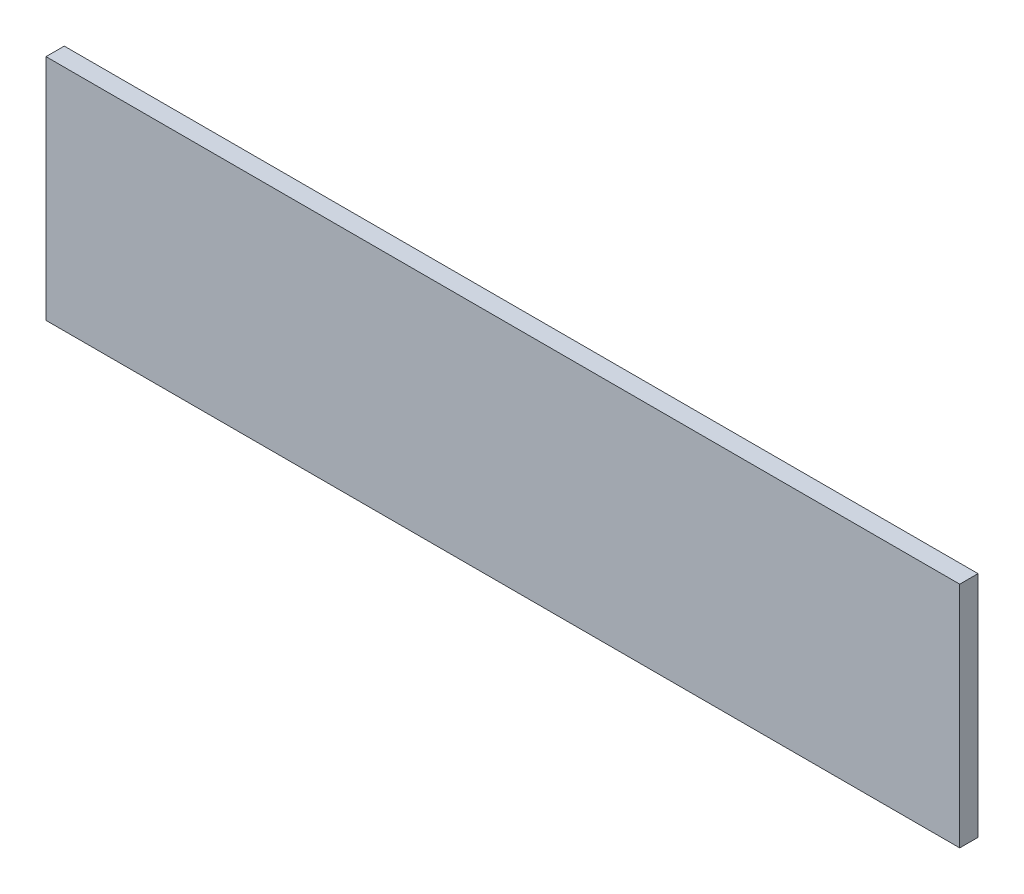
ISO-10303-21;
HEADER;
FILE_DESCRIPTION(('STEP AP214'),'2;1');
FILE_NAME('part.step','',(''),(''),'','','');
FILE_SCHEMA(('AUTOMOTIVE_DESIGN { 1 0 10303 214 1 1 1 1 }'));
ENDSEC;
DATA;
#1=APPLICATION_CONTEXT('core data for automotive mechanical design processes');
#2=APPLICATION_PROTOCOL_DEFINITION('international standard','automotive_design',2000,#1);
#3=PRODUCT_CONTEXT('',#1,'mechanical');
#4=PRODUCT('Part','Part','',(#3));
#5=PRODUCT_RELATED_PRODUCT_CATEGORY('part','',(#4));
#6=PRODUCT_DEFINITION_FORMATION('','',#4);
#7=PRODUCT_DEFINITION_CONTEXT('part definition',#1,'design');
#8=PRODUCT_DEFINITION('design','',#6,#7);
#9=PRODUCT_DEFINITION_SHAPE('','',#8);
#10=(LENGTH_UNIT() NAMED_UNIT(*) SI_UNIT(.MILLI.,.METRE.));
#11=(NAMED_UNIT(*) PLANE_ANGLE_UNIT() SI_UNIT($,.RADIAN.));
#12=(NAMED_UNIT(*) SI_UNIT($,.STERADIAN.) SOLID_ANGLE_UNIT());
#13=UNCERTAINTY_MEASURE_WITH_UNIT(LENGTH_MEASURE(1.E-05),#10,'distance_accuracy_value','');
#14=(GEOMETRIC_REPRESENTATION_CONTEXT(3) GLOBAL_UNCERTAINTY_ASSIGNED_CONTEXT((#13)) GLOBAL_UNIT_ASSIGNED_CONTEXT((#10,
#11,#12)) REPRESENTATION_CONTEXT('',''));
#15=CARTESIAN_POINT('',(0.,0.,0.));
#16=DIRECTION('',(0.,0.,1.));
#17=DIRECTION('',(1.,0.,0.));
#18=AXIS2_PLACEMENT_3D('',#15,#16,#17);
#19=CARTESIAN_POINT('',(500.,-125.,20.));
#20=DIRECTION('',(-1.,0.,0.));
#21=DIRECTION('',(0.,0.,1.));
#22=AXIS2_PLACEMENT_3D('',#19,#20,#21);
#23=PLANE('',#22);
#24=DIRECTION('',(0.,1.,0.));
#25=VECTOR('',#24,1.);
#26=CARTESIAN_POINT('',(500.,-125.,0.));
#27=LINE('',#26,#25);
#28=CARTESIAN_POINT('',(500.,-125.,0.));
#29=VERTEX_POINT('',#28);
#30=CARTESIAN_POINT('',(500.,125.,0.));
#31=VERTEX_POINT('',#30);
#32=EDGE_CURVE('E107',#29,#31,#27,.T.);
#33=ORIENTED_EDGE('',*,*,#32,.T.);
#34=DIRECTION('',(0.,0.,-1.));
#35=VECTOR('',#34,1.);
#36=CARTESIAN_POINT('',(500.,125.,20.));
#37=LINE('',#36,#35);
#38=CARTESIAN_POINT('',(500.,125.,20.));
#39=VERTEX_POINT('',#38);
#40=EDGE_CURVE('E11',#39,#31,#37,.T.);
#41=ORIENTED_EDGE('',*,*,#40,.F.);
#42=DIRECTION('',(0.,1.,0.));
#43=VECTOR('',#42,1.);
#44=CARTESIAN_POINT('',(500.,-125.,20.));
#45=LINE('',#44,#43);
#46=CARTESIAN_POINT('',(500.,-125.,20.));
#47=VERTEX_POINT('',#46);
#48=EDGE_CURVE('E91',#47,#39,#45,.T.);
#49=ORIENTED_EDGE('',*,*,#48,.F.);
#50=DIRECTION('',(0.,0.,-1.));
#51=VECTOR('',#50,1.);
#52=CARTESIAN_POINT('',(500.,-125.,20.));
#53=LINE('',#52,#51);
#54=EDGE_CURVE('E103',#47,#29,#53,.T.);
#55=ORIENTED_EDGE('',*,*,#54,.T.);
#56=EDGE_LOOP('',(#33,#41,#49,#55));
#57=FACE_BOUND('',#56,.T.);
#58=ADVANCED_FACE('F39',(#57),#23,.F.);
#59=CARTESIAN_POINT('',(-500.,125.,20.));
#60=DIRECTION('',(0.,-1.,0.));
#61=DIRECTION('',(0.,0.,-1.));
#62=AXIS2_PLACEMENT_3D('',#59,#60,#61);
#63=PLANE('',#62);
#64=DIRECTION('',(-1.,0.,0.));
#65=VECTOR('',#64,1.);
#66=CARTESIAN_POINT('',(-500.,125.,0.));
#67=LINE('',#66,#65);
#68=CARTESIAN_POINT('',(-500.,125.,0.));
#69=VERTEX_POINT('',#68);
#70=EDGE_CURVE('E96',#31,#69,#67,.T.);
#71=ORIENTED_EDGE('',*,*,#70,.T.);
#72=DIRECTION('',(0.,0.,-1.));
#73=VECTOR('',#72,1.);
#74=CARTESIAN_POINT('',(-500.,125.,20.));
#75=LINE('',#74,#73);
#76=CARTESIAN_POINT('',(-500.,125.,20.));
#77=VERTEX_POINT('',#76);
#78=EDGE_CURVE('E48',#77,#69,#75,.T.);
#79=ORIENTED_EDGE('',*,*,#78,.F.);
#80=DIRECTION('',(-1.,0.,0.));
#81=VECTOR('',#80,1.);
#82=CARTESIAN_POINT('',(-500.,125.,20.));
#83=LINE('',#82,#81);
#84=EDGE_CURVE('E86',#39,#77,#83,.T.);
#85=ORIENTED_EDGE('',*,*,#84,.F.);
#86=ORIENTED_EDGE('',*,*,#40,.T.);
#87=EDGE_LOOP('',(#71,#79,#85,#86));
#88=FACE_BOUND('',#87,.T.);
#89=ADVANCED_FACE('F95',(#88),#63,.F.);
#90=CARTESIAN_POINT('',(-500.,-125.,20.));
#91=DIRECTION('',(1.,0.,0.));
#92=DIRECTION('',(0.,0.,-1.));
#93=AXIS2_PLACEMENT_3D('',#90,#91,#92);
#94=PLANE('',#93);
#95=DIRECTION('',(0.,-1.,0.));
#96=VECTOR('',#95,1.);
#97=CARTESIAN_POINT('',(-500.,-125.,0.));
#98=LINE('',#97,#96);
#99=CARTESIAN_POINT('',(-500.,-125.,0.));
#100=VERTEX_POINT('',#99);
#101=EDGE_CURVE('E73',#69,#100,#98,.T.);
#102=ORIENTED_EDGE('',*,*,#101,.T.);
#103=DIRECTION('',(0.,0.,-1.));
#104=VECTOR('',#103,1.);
#105=CARTESIAN_POINT('',(-500.,-125.,20.));
#106=LINE('',#105,#104);
#107=CARTESIAN_POINT('',(-500.,-125.,20.));
#108=VERTEX_POINT('',#107);
#109=EDGE_CURVE('E98',#108,#100,#106,.T.);
#110=ORIENTED_EDGE('',*,*,#109,.F.);
#111=DIRECTION('',(0.,-1.,0.));
#112=VECTOR('',#111,1.);
#113=CARTESIAN_POINT('',(-500.,-125.,20.));
#114=LINE('',#113,#112);
#115=EDGE_CURVE('E89',#77,#108,#114,.T.);
#116=ORIENTED_EDGE('',*,*,#115,.F.);
#117=ORIENTED_EDGE('',*,*,#78,.T.);
#118=EDGE_LOOP('',(#102,#110,#116,#117));
#119=FACE_BOUND('',#118,.T.);
#120=ADVANCED_FACE('F99',(#119),#94,.F.);
#121=CARTESIAN_POINT('',(-500.,-125.,20.));
#122=DIRECTION('',(0.,1.,0.));
#123=DIRECTION('',(0.,0.,1.));
#124=AXIS2_PLACEMENT_3D('',#121,#122,#123);
#125=PLANE('',#124);
#126=DIRECTION('',(1.,0.,0.));
#127=VECTOR('',#126,1.);
#128=CARTESIAN_POINT('',(-500.,-125.,0.));
#129=LINE('',#128,#127);
#130=EDGE_CURVE('E79',#100,#29,#129,.T.);
#131=ORIENTED_EDGE('',*,*,#130,.T.);
#132=ORIENTED_EDGE('',*,*,#54,.F.);
#133=DIRECTION('',(1.,0.,0.));
#134=VECTOR('',#133,1.);
#135=CARTESIAN_POINT('',(-500.,-125.,20.));
#136=LINE('',#135,#134);
#137=EDGE_CURVE('E56',#108,#47,#136,.T.);
#138=ORIENTED_EDGE('',*,*,#137,.F.);
#139=ORIENTED_EDGE('',*,*,#109,.T.);
#140=EDGE_LOOP('',(#131,#132,#138,#139));
#141=FACE_BOUND('',#140,.T.);
#142=ADVANCED_FACE('F120',(#141),#125,.F.);
#143=CARTESIAN_POINT('',(0.,0.,20.));
#144=DIRECTION('',(0.,0.,-1.));
#145=DIRECTION('',(-1.,0.,0.));
#146=AXIS2_PLACEMENT_3D('',#143,#144,#145);
#147=PLANE('',#146);
#148=ORIENTED_EDGE('',*,*,#48,.T.);
#149=ORIENTED_EDGE('',*,*,#84,.T.);
#150=ORIENTED_EDGE('',*,*,#115,.T.);
#151=ORIENTED_EDGE('',*,*,#137,.T.);
#152=EDGE_LOOP('',(#148,#149,#150,#151));
#153=FACE_BOUND('',#152,.T.);
#154=ADVANCED_FACE('F87',(#153),#147,.F.);
#155=CARTESIAN_POINT('',(0.,0.,0.));
#156=DIRECTION('',(0.,0.,-1.));
#157=DIRECTION('',(-1.,0.,0.));
#158=AXIS2_PLACEMENT_3D('',#155,#156,#157);
#159=PLANE('',#158);
#160=ORIENTED_EDGE('',*,*,#32,.F.);
#161=ORIENTED_EDGE('',*,*,#130,.F.);
#162=ORIENTED_EDGE('',*,*,#101,.F.);
#163=ORIENTED_EDGE('',*,*,#70,.F.);
#164=EDGE_LOOP('',(#160,#161,#162,#163));
#165=FACE_BOUND('',#164,.T.);
#166=ADVANCED_FACE('F123',(#165),#159,.T.);
#167=CLOSED_SHELL('',(#58,#89,#120,#142,#154,#166));
#168=MANIFOLD_SOLID_BREP('B2',#167);
#169=ADVANCED_BREP_SHAPE_REPRESENTATION('',(#18,#168),#14);
#170=SHAPE_DEFINITION_REPRESENTATION(#9,#169);
ENDSEC;
END-ISO-10303-21;
